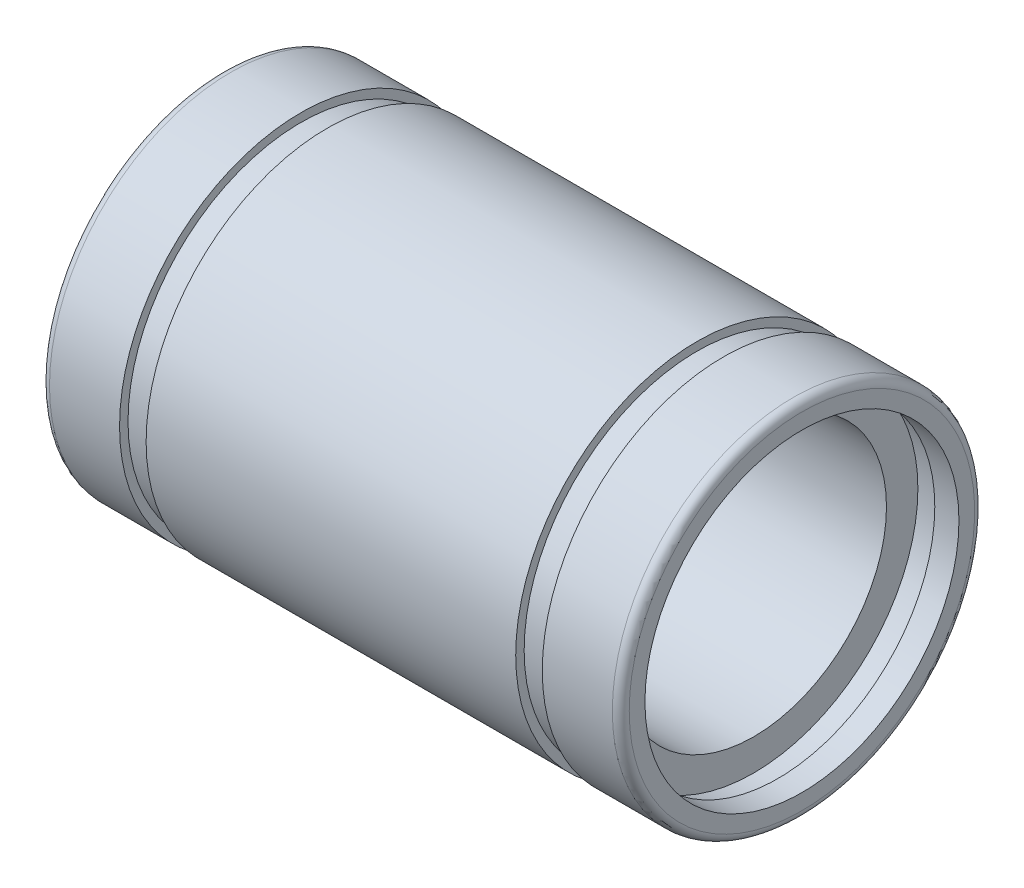
ISO-10303-21;
HEADER;
FILE_DESCRIPTION(('STEP AP214'),'2;1');
FILE_NAME('part.step','',(''),(''),'','','');
FILE_SCHEMA(('AUTOMOTIVE_DESIGN { 1 0 10303 214 1 1 1 1 }'));
ENDSEC;
DATA;
#1=APPLICATION_CONTEXT('core data for automotive mechanical design processes');
#2=APPLICATION_PROTOCOL_DEFINITION('international standard','automotive_design',2000,#1);
#3=PRODUCT_CONTEXT('',#1,'mechanical');
#4=PRODUCT('Part','Part','',(#3));
#5=PRODUCT_RELATED_PRODUCT_CATEGORY('part','',(#4));
#6=PRODUCT_DEFINITION_FORMATION('','',#4);
#7=PRODUCT_DEFINITION_CONTEXT('part definition',#1,'design');
#8=PRODUCT_DEFINITION('design','',#6,#7);
#9=PRODUCT_DEFINITION_SHAPE('','',#8);
#10=(LENGTH_UNIT() NAMED_UNIT(*) SI_UNIT(.MILLI.,.METRE.));
#11=(NAMED_UNIT(*) PLANE_ANGLE_UNIT() SI_UNIT($,.RADIAN.));
#12=(NAMED_UNIT(*) SI_UNIT($,.STERADIAN.) SOLID_ANGLE_UNIT());
#13=UNCERTAINTY_MEASURE_WITH_UNIT(LENGTH_MEASURE(1.E-05),#10,'distance_accuracy_value','');
#14=(GEOMETRIC_REPRESENTATION_CONTEXT(3) GLOBAL_UNCERTAINTY_ASSIGNED_CONTEXT((#13)) GLOBAL_UNIT_ASSIGNED_CONTEXT((#10,
#11,#12)) REPRESENTATION_CONTEXT('',''));
#15=CARTESIAN_POINT('',(0.,0.,0.));
#16=DIRECTION('',(0.,0.,1.));
#17=DIRECTION('',(1.,0.,0.));
#18=AXIS2_PLACEMENT_3D('',#15,#16,#17);
#19=CARTESIAN_POINT('',(23.65,0.,0.));
#20=DIRECTION('',(-1.,0.,0.));
#21=DIRECTION('',(0.,0.,1.));
#22=AXIS2_PLACEMENT_3D('',#19,#20,#21);
#23=TOROIDAL_SURFACE('',#22,7.15,0.35);
#24=CARTESIAN_POINT('',(23.65,0.,0.));
#25=DIRECTION('',(-1.,0.,0.));
#26=DIRECTION('',(0.,0.,1.));
#27=AXIS2_PLACEMENT_3D('',#24,#25,#26);
#28=CIRCLE('',#27,7.5);
#29=CARTESIAN_POINT('',(23.65,0.,7.5));
#30=VERTEX_POINT('',#29);
#31=EDGE_CURVE('E10',#30,#30,#28,.T.);
#32=ORIENTED_EDGE('',*,*,#31,.F.);
#33=EDGE_LOOP('',(#32));
#34=FACE_BOUND('',#33,.T.);
#35=CARTESIAN_POINT('',(24.,0.,0.));
#36=DIRECTION('',(-1.,0.,0.));
#37=DIRECTION('',(0.,0.,1.));
#38=AXIS2_PLACEMENT_3D('',#35,#36,#37);
#39=CIRCLE('',#38,7.15);
#40=CARTESIAN_POINT('',(24.,0.,7.15));
#41=VERTEX_POINT('',#40);
#42=EDGE_CURVE('E101',#41,#41,#39,.T.);
#43=ORIENTED_EDGE('',*,*,#42,.T.);
#44=EDGE_LOOP('',(#43));
#45=FACE_BOUND('',#44,.T.);
#46=ADVANCED_FACE('F31',(#34,#45),#23,.T.);
#47=CARTESIAN_POINT('',(0.,0.,0.));
#48=DIRECTION('',(-1.,0.,0.));
#49=DIRECTION('',(0.,0.,1.));
#50=AXIS2_PLACEMENT_3D('',#47,#48,#49);
#51=CYLINDRICAL_SURFACE('',#50,7.5);
#52=CARTESIAN_POINT('',(20.75,0.,0.));
#53=DIRECTION('',(-1.,0.,0.));
#54=DIRECTION('',(0.,0.,1.));
#55=AXIS2_PLACEMENT_3D('',#52,#53,#54);
#56=CIRCLE('',#55,7.5);
#57=CARTESIAN_POINT('',(20.75,0.,7.5));
#58=VERTEX_POINT('',#57);
#59=EDGE_CURVE('E37',#58,#58,#56,.T.);
#60=ORIENTED_EDGE('',*,*,#59,.F.);
#61=EDGE_LOOP('',(#60));
#62=FACE_BOUND('',#61,.T.);
#63=ORIENTED_EDGE('',*,*,#31,.T.);
#64=EDGE_LOOP('',(#63));
#65=FACE_BOUND('',#64,.T.);
#66=ADVANCED_FACE('F222',(#62,#65),#51,.T.);
#67=CARTESIAN_POINT('',(20.75,7.5,0.));
#68=DIRECTION('',(1.,0.,0.));
#69=DIRECTION('',(0.,0.,-1.));
#70=AXIS2_PLACEMENT_3D('',#67,#68,#69);
#71=PLANE('',#70);
#72=CARTESIAN_POINT('',(20.75,0.,0.));
#73=DIRECTION('',(-1.,0.,0.));
#74=DIRECTION('',(0.,0.,1.));
#75=AXIS2_PLACEMENT_3D('',#72,#73,#74);
#76=CIRCLE('',#75,7.15);
#77=CARTESIAN_POINT('',(20.75,0.,7.15));
#78=VERTEX_POINT('',#77);
#79=EDGE_CURVE('E41',#78,#78,#76,.T.);
#80=ORIENTED_EDGE('',*,*,#79,.F.);
#81=EDGE_LOOP('',(#80));
#82=FACE_BOUND('',#81,.T.);
#83=ORIENTED_EDGE('',*,*,#59,.T.);
#84=EDGE_LOOP('',(#83));
#85=FACE_BOUND('',#84,.T.);
#86=ADVANCED_FACE('F217',(#82,#85),#71,.F.);
#87=CARTESIAN_POINT('',(0.,0.,0.));
#88=DIRECTION('',(-1.,0.,0.));
#89=DIRECTION('',(0.,0.,1.));
#90=AXIS2_PLACEMENT_3D('',#87,#88,#89);
#91=CYLINDRICAL_SURFACE('',#90,7.15);
#92=CARTESIAN_POINT('',(19.65,0.,0.));
#93=DIRECTION('',(-1.,0.,0.));
#94=DIRECTION('',(0.,0.,1.));
#95=AXIS2_PLACEMENT_3D('',#92,#93,#94);
#96=CIRCLE('',#95,7.15);
#97=CARTESIAN_POINT('',(19.65,0.,7.15));
#98=VERTEX_POINT('',#97);
#99=EDGE_CURVE('E45',#98,#98,#96,.T.);
#100=ORIENTED_EDGE('',*,*,#99,.F.);
#101=EDGE_LOOP('',(#100));
#102=FACE_BOUND('',#101,.T.);
#103=ORIENTED_EDGE('',*,*,#79,.T.);
#104=EDGE_LOOP('',(#103));
#105=FACE_BOUND('',#104,.T.);
#106=ADVANCED_FACE('F211',(#102,#105),#91,.T.);
#107=CARTESIAN_POINT('',(19.65,7.15,0.));
#108=DIRECTION('',(-1.,0.,0.));
#109=DIRECTION('',(0.,0.,1.));
#110=AXIS2_PLACEMENT_3D('',#107,#108,#109);
#111=PLANE('',#110);
#112=CARTESIAN_POINT('',(19.65,0.,0.));
#113=DIRECTION('',(-1.,0.,0.));
#114=DIRECTION('',(0.,0.,1.));
#115=AXIS2_PLACEMENT_3D('',#112,#113,#114);
#116=CIRCLE('',#115,7.5);
#117=CARTESIAN_POINT('',(19.65,0.,7.5));
#118=VERTEX_POINT('',#117);
#119=EDGE_CURVE('E50',#118,#118,#116,.T.);
#120=ORIENTED_EDGE('',*,*,#119,.F.);
#121=EDGE_LOOP('',(#120));
#122=FACE_BOUND('',#121,.T.);
#123=ORIENTED_EDGE('',*,*,#99,.T.);
#124=EDGE_LOOP('',(#123));
#125=FACE_BOUND('',#124,.T.);
#126=ADVANCED_FACE('F205',(#122,#125),#111,.F.);
#127=CARTESIAN_POINT('',(0.,0.,0.));
#128=DIRECTION('',(-1.,0.,0.));
#129=DIRECTION('',(0.,0.,1.));
#130=AXIS2_PLACEMENT_3D('',#127,#128,#129);
#131=CYLINDRICAL_SURFACE('',#130,7.5);
#132=CARTESIAN_POINT('',(4.35,0.,0.));
#133=DIRECTION('',(-1.,0.,0.));
#134=DIRECTION('',(0.,0.,1.));
#135=AXIS2_PLACEMENT_3D('',#132,#133,#134);
#136=CIRCLE('',#135,7.5);
#137=CARTESIAN_POINT('',(4.35,0.,7.5));
#138=VERTEX_POINT('',#137);
#139=EDGE_CURVE('E53',#138,#138,#136,.T.);
#140=ORIENTED_EDGE('',*,*,#139,.F.);
#141=EDGE_LOOP('',(#140));
#142=FACE_BOUND('',#141,.T.);
#143=ORIENTED_EDGE('',*,*,#119,.T.);
#144=EDGE_LOOP('',(#143));
#145=FACE_BOUND('',#144,.T.);
#146=ADVANCED_FACE('F199',(#142,#145),#131,.T.);
#147=CARTESIAN_POINT('',(4.35,7.5,0.));
#148=DIRECTION('',(1.,0.,0.));
#149=DIRECTION('',(0.,0.,-1.));
#150=AXIS2_PLACEMENT_3D('',#147,#148,#149);
#151=PLANE('',#150);
#152=CARTESIAN_POINT('',(4.35,0.,0.));
#153=DIRECTION('',(-1.,0.,0.));
#154=DIRECTION('',(0.,0.,1.));
#155=AXIS2_PLACEMENT_3D('',#152,#153,#154);
#156=CIRCLE('',#155,7.15);
#157=CARTESIAN_POINT('',(4.35,0.,7.15));
#158=VERTEX_POINT('',#157);
#159=EDGE_CURVE('E56',#158,#158,#156,.T.);
#160=ORIENTED_EDGE('',*,*,#159,.F.);
#161=EDGE_LOOP('',(#160));
#162=FACE_BOUND('',#161,.T.);
#163=ORIENTED_EDGE('',*,*,#139,.T.);
#164=EDGE_LOOP('',(#163));
#165=FACE_BOUND('',#164,.T.);
#166=ADVANCED_FACE('F193',(#162,#165),#151,.F.);
#167=CARTESIAN_POINT('',(0.,0.,0.));
#168=DIRECTION('',(-1.,0.,0.));
#169=DIRECTION('',(0.,0.,1.));
#170=AXIS2_PLACEMENT_3D('',#167,#168,#169);
#171=CYLINDRICAL_SURFACE('',#170,7.15);
#172=CARTESIAN_POINT('',(3.25,0.,0.));
#173=DIRECTION('',(-1.,0.,0.));
#174=DIRECTION('',(0.,0.,1.));
#175=AXIS2_PLACEMENT_3D('',#172,#173,#174);
#176=CIRCLE('',#175,7.15);
#177=CARTESIAN_POINT('',(3.25,0.,7.15));
#178=VERTEX_POINT('',#177);
#179=EDGE_CURVE('E59',#178,#178,#176,.T.);
#180=ORIENTED_EDGE('',*,*,#179,.F.);
#181=EDGE_LOOP('',(#180));
#182=FACE_BOUND('',#181,.T.);
#183=ORIENTED_EDGE('',*,*,#159,.T.);
#184=EDGE_LOOP('',(#183));
#185=FACE_BOUND('',#184,.T.);
#186=ADVANCED_FACE('F187',(#182,#185),#171,.T.);
#187=CARTESIAN_POINT('',(3.25,7.15,0.));
#188=DIRECTION('',(-1.,0.,0.));
#189=DIRECTION('',(0.,0.,1.));
#190=AXIS2_PLACEMENT_3D('',#187,#188,#189);
#191=PLANE('',#190);
#192=CARTESIAN_POINT('',(3.25,0.,0.));
#193=DIRECTION('',(-1.,0.,0.));
#194=DIRECTION('',(0.,0.,1.));
#195=AXIS2_PLACEMENT_3D('',#192,#193,#194);
#196=CIRCLE('',#195,7.5);
#197=CARTESIAN_POINT('',(3.25,0.,7.5));
#198=VERTEX_POINT('',#197);
#199=EDGE_CURVE('E62',#198,#198,#196,.T.);
#200=ORIENTED_EDGE('',*,*,#199,.F.);
#201=EDGE_LOOP('',(#200));
#202=FACE_BOUND('',#201,.T.);
#203=ORIENTED_EDGE('',*,*,#179,.T.);
#204=EDGE_LOOP('',(#203));
#205=FACE_BOUND('',#204,.T.);
#206=ADVANCED_FACE('F181',(#202,#205),#191,.F.);
#207=CARTESIAN_POINT('',(0.,0.,0.));
#208=DIRECTION('',(-1.,0.,0.));
#209=DIRECTION('',(0.,0.,1.));
#210=AXIS2_PLACEMENT_3D('',#207,#208,#209);
#211=CYLINDRICAL_SURFACE('',#210,7.5);
#212=CARTESIAN_POINT('',(0.350000000000002,0.,0.));
#213=DIRECTION('',(-1.,0.,0.));
#214=DIRECTION('',(0.,0.,1.));
#215=AXIS2_PLACEMENT_3D('',#212,#213,#214);
#216=CIRCLE('',#215,7.5);
#217=CARTESIAN_POINT('',(0.350000000000002,0.,7.5));
#218=VERTEX_POINT('',#217);
#219=EDGE_CURVE('E65',#218,#218,#216,.T.);
#220=ORIENTED_EDGE('',*,*,#219,.F.);
#221=EDGE_LOOP('',(#220));
#222=FACE_BOUND('',#221,.T.);
#223=ORIENTED_EDGE('',*,*,#199,.T.);
#224=EDGE_LOOP('',(#223));
#225=FACE_BOUND('',#224,.T.);
#226=ADVANCED_FACE('F175',(#222,#225),#211,.T.);
#227=CARTESIAN_POINT('',(0.35,0.,0.));
#228=DIRECTION('',(-1.,0.,0.));
#229=DIRECTION('',(0.,0.,1.));
#230=AXIS2_PLACEMENT_3D('',#227,#228,#229);
#231=TOROIDAL_SURFACE('',#230,7.15,0.35);
#232=CARTESIAN_POINT('',(0.,0.,0.));
#233=DIRECTION('',(-1.,0.,0.));
#234=DIRECTION('',(0.,0.,1.));
#235=AXIS2_PLACEMENT_3D('',#232,#233,#234);
#236=CIRCLE('',#235,7.15);
#237=CARTESIAN_POINT('',(0.,0.,7.15));
#238=VERTEX_POINT('',#237);
#239=EDGE_CURVE('E68',#238,#238,#236,.T.);
#240=ORIENTED_EDGE('',*,*,#239,.F.);
#241=EDGE_LOOP('',(#240));
#242=FACE_BOUND('',#241,.T.);
#243=ORIENTED_EDGE('',*,*,#219,.T.);
#244=EDGE_LOOP('',(#243));
#245=FACE_BOUND('',#244,.T.);
#246=ADVANCED_FACE('F169',(#242,#245),#231,.T.);
#247=CARTESIAN_POINT('',(0.,7.15,0.));
#248=DIRECTION('',(1.,0.,0.));
#249=DIRECTION('',(0.,0.,-1.));
#250=AXIS2_PLACEMENT_3D('',#247,#248,#249);
#251=PLANE('',#250);
#252=CARTESIAN_POINT('',(0.,0.,0.));
#253=DIRECTION('',(-1.,0.,0.));
#254=DIRECTION('',(0.,0.,1.));
#255=AXIS2_PLACEMENT_3D('',#252,#253,#254);
#256=CIRCLE('',#255,6.5);
#257=CARTESIAN_POINT('',(0.,0.,6.5));
#258=VERTEX_POINT('',#257);
#259=EDGE_CURVE('E71',#258,#258,#256,.T.);
#260=ORIENTED_EDGE('',*,*,#259,.F.);
#261=EDGE_LOOP('',(#260));
#262=FACE_BOUND('',#261,.T.);
#263=ORIENTED_EDGE('',*,*,#239,.T.);
#264=EDGE_LOOP('',(#263));
#265=FACE_BOUND('',#264,.T.);
#266=ADVANCED_FACE('F163',(#262,#265),#251,.F.);
#267=CARTESIAN_POINT('',(0.,0.,0.));
#268=DIRECTION('',(-1.,0.,0.));
#269=DIRECTION('',(0.,0.,1.));
#270=AXIS2_PLACEMENT_3D('',#267,#268,#269);
#271=CYLINDRICAL_SURFACE('',#270,6.5);
#272=CARTESIAN_POINT('',(1.,0.,0.));
#273=DIRECTION('',(-1.,0.,0.));
#274=DIRECTION('',(0.,0.,1.));
#275=AXIS2_PLACEMENT_3D('',#272,#273,#274);
#276=CIRCLE('',#275,6.5);
#277=CARTESIAN_POINT('',(1.,0.,6.5));
#278=VERTEX_POINT('',#277);
#279=EDGE_CURVE('E74',#278,#278,#276,.T.);
#280=ORIENTED_EDGE('',*,*,#279,.F.);
#281=EDGE_LOOP('',(#280));
#282=FACE_BOUND('',#281,.T.);
#283=ORIENTED_EDGE('',*,*,#259,.T.);
#284=EDGE_LOOP('',(#283));
#285=FACE_BOUND('',#284,.T.);
#286=ADVANCED_FACE('F157',(#282,#285),#271,.F.);
#287=CARTESIAN_POINT('',(1.,6.8,0.));
#288=DIRECTION('',(-1.,0.,0.));
#289=DIRECTION('',(0.,0.,1.));
#290=AXIS2_PLACEMENT_3D('',#287,#288,#289);
#291=PLANE('',#290);
#292=CARTESIAN_POINT('',(1.,0.,0.));
#293=DIRECTION('',(-1.,0.,0.));
#294=DIRECTION('',(0.,0.,1.));
#295=AXIS2_PLACEMENT_3D('',#292,#293,#294);
#296=CIRCLE('',#295,6.8);
#297=CARTESIAN_POINT('',(1.,0.,6.8));
#298=VERTEX_POINT('',#297);
#299=EDGE_CURVE('E77',#298,#298,#296,.T.);
#300=ORIENTED_EDGE('',*,*,#299,.F.);
#301=EDGE_LOOP('',(#300));
#302=FACE_BOUND('',#301,.T.);
#303=ORIENTED_EDGE('',*,*,#279,.T.);
#304=EDGE_LOOP('',(#303));
#305=FACE_BOUND('',#304,.T.);
#306=ADVANCED_FACE('F151',(#302,#305),#291,.F.);
#307=CARTESIAN_POINT('',(0.,0.,0.));
#308=DIRECTION('',(-1.,0.,0.));
#309=DIRECTION('',(0.,0.,1.));
#310=AXIS2_PLACEMENT_3D('',#307,#308,#309);
#311=CYLINDRICAL_SURFACE('',#310,6.8);
#312=CARTESIAN_POINT('',(2.,0.,0.));
#313=DIRECTION('',(-1.,0.,0.));
#314=DIRECTION('',(0.,0.,1.));
#315=AXIS2_PLACEMENT_3D('',#312,#313,#314);
#316=CIRCLE('',#315,6.8);
#317=CARTESIAN_POINT('',(2.,0.,6.8));
#318=VERTEX_POINT('',#317);
#319=EDGE_CURVE('E80',#318,#318,#316,.T.);
#320=ORIENTED_EDGE('',*,*,#319,.F.);
#321=EDGE_LOOP('',(#320));
#322=FACE_BOUND('',#321,.T.);
#323=ORIENTED_EDGE('',*,*,#299,.T.);
#324=EDGE_LOOP('',(#323));
#325=FACE_BOUND('',#324,.T.);
#326=ADVANCED_FACE('F145',(#322,#325),#311,.F.);
#327=CARTESIAN_POINT('',(2.,6.8,0.));
#328=DIRECTION('',(1.,0.,0.));
#329=DIRECTION('',(0.,0.,-1.));
#330=AXIS2_PLACEMENT_3D('',#327,#328,#329);
#331=PLANE('',#330);
#332=CARTESIAN_POINT('',(2.,0.,0.));
#333=DIRECTION('',(-1.,0.,0.));
#334=DIRECTION('',(0.,0.,1.));
#335=AXIS2_PLACEMENT_3D('',#332,#333,#334);
#336=CIRCLE('',#335,5.5);
#337=CARTESIAN_POINT('',(2.,0.,5.5));
#338=VERTEX_POINT('',#337);
#339=EDGE_CURVE('E83',#338,#338,#336,.T.);
#340=ORIENTED_EDGE('',*,*,#339,.F.);
#341=EDGE_LOOP('',(#340));
#342=FACE_BOUND('',#341,.T.);
#343=ORIENTED_EDGE('',*,*,#319,.T.);
#344=EDGE_LOOP('',(#343));
#345=FACE_BOUND('',#344,.T.);
#346=ADVANCED_FACE('F139',(#342,#345),#331,.F.);
#347=CARTESIAN_POINT('',(0.,0.,0.));
#348=DIRECTION('',(-1.,0.,0.));
#349=DIRECTION('',(0.,0.,1.));
#350=AXIS2_PLACEMENT_3D('',#347,#348,#349);
#351=CYLINDRICAL_SURFACE('',#350,5.5);
#352=CARTESIAN_POINT('',(22.,0.,0.));
#353=DIRECTION('',(-1.,0.,0.));
#354=DIRECTION('',(0.,0.,1.));
#355=AXIS2_PLACEMENT_3D('',#352,#353,#354);
#356=CIRCLE('',#355,5.5);
#357=CARTESIAN_POINT('',(22.,0.,5.5));
#358=VERTEX_POINT('',#357);
#359=EDGE_CURVE('E86',#358,#358,#356,.T.);
#360=ORIENTED_EDGE('',*,*,#359,.F.);
#361=EDGE_LOOP('',(#360));
#362=FACE_BOUND('',#361,.T.);
#363=ORIENTED_EDGE('',*,*,#339,.T.);
#364=EDGE_LOOP('',(#363));
#365=FACE_BOUND('',#364,.T.);
#366=ADVANCED_FACE('F133',(#362,#365),#351,.F.);
#367=CARTESIAN_POINT('',(22.,5.5,0.));
#368=DIRECTION('',(-1.,0.,0.));
#369=DIRECTION('',(0.,0.,1.));
#370=AXIS2_PLACEMENT_3D('',#367,#368,#369);
#371=PLANE('',#370);
#372=CARTESIAN_POINT('',(22.,0.,0.));
#373=DIRECTION('',(-1.,0.,0.));
#374=DIRECTION('',(0.,0.,1.));
#375=AXIS2_PLACEMENT_3D('',#372,#373,#374);
#376=CIRCLE('',#375,6.8);
#377=CARTESIAN_POINT('',(22.,0.,6.8));
#378=VERTEX_POINT('',#377);
#379=EDGE_CURVE('E89',#378,#378,#376,.T.);
#380=ORIENTED_EDGE('',*,*,#379,.F.);
#381=EDGE_LOOP('',(#380));
#382=FACE_BOUND('',#381,.T.);
#383=ORIENTED_EDGE('',*,*,#359,.T.);
#384=EDGE_LOOP('',(#383));
#385=FACE_BOUND('',#384,.T.);
#386=ADVANCED_FACE('F127',(#382,#385),#371,.F.);
#387=CARTESIAN_POINT('',(0.,0.,0.));
#388=DIRECTION('',(-1.,0.,0.));
#389=DIRECTION('',(0.,0.,1.));
#390=AXIS2_PLACEMENT_3D('',#387,#388,#389);
#391=CYLINDRICAL_SURFACE('',#390,6.8);
#392=CARTESIAN_POINT('',(23.,0.,0.));
#393=DIRECTION('',(-1.,0.,0.));
#394=DIRECTION('',(0.,0.,1.));
#395=AXIS2_PLACEMENT_3D('',#392,#393,#394);
#396=CIRCLE('',#395,6.8);
#397=CARTESIAN_POINT('',(23.,0.,6.8));
#398=VERTEX_POINT('',#397);
#399=EDGE_CURVE('E92',#398,#398,#396,.T.);
#400=ORIENTED_EDGE('',*,*,#399,.F.);
#401=EDGE_LOOP('',(#400));
#402=FACE_BOUND('',#401,.T.);
#403=ORIENTED_EDGE('',*,*,#379,.T.);
#404=EDGE_LOOP('',(#403));
#405=FACE_BOUND('',#404,.T.);
#406=ADVANCED_FACE('F121',(#402,#405),#391,.F.);
#407=CARTESIAN_POINT('',(23.,6.8,0.));
#408=DIRECTION('',(1.,0.,0.));
#409=DIRECTION('',(0.,0.,-1.));
#410=AXIS2_PLACEMENT_3D('',#407,#408,#409);
#411=PLANE('',#410);
#412=CARTESIAN_POINT('',(23.,0.,0.));
#413=DIRECTION('',(-1.,0.,0.));
#414=DIRECTION('',(0.,0.,1.));
#415=AXIS2_PLACEMENT_3D('',#412,#413,#414);
#416=CIRCLE('',#415,6.5);
#417=CARTESIAN_POINT('',(23.,0.,6.5));
#418=VERTEX_POINT('',#417);
#419=EDGE_CURVE('E95',#418,#418,#416,.T.);
#420=ORIENTED_EDGE('',*,*,#419,.F.);
#421=EDGE_LOOP('',(#420));
#422=FACE_BOUND('',#421,.T.);
#423=ORIENTED_EDGE('',*,*,#399,.T.);
#424=EDGE_LOOP('',(#423));
#425=FACE_BOUND('',#424,.T.);
#426=ADVANCED_FACE('F115',(#422,#425),#411,.F.);
#427=CARTESIAN_POINT('',(0.,0.,0.));
#428=DIRECTION('',(-1.,0.,0.));
#429=DIRECTION('',(0.,0.,1.));
#430=AXIS2_PLACEMENT_3D('',#427,#428,#429);
#431=CYLINDRICAL_SURFACE('',#430,6.5);
#432=CARTESIAN_POINT('',(24.,0.,0.));
#433=DIRECTION('',(-1.,0.,0.));
#434=DIRECTION('',(0.,0.,1.));
#435=AXIS2_PLACEMENT_3D('',#432,#433,#434);
#436=CIRCLE('',#435,6.5);
#437=CARTESIAN_POINT('',(24.,0.,6.5));
#438=VERTEX_POINT('',#437);
#439=EDGE_CURVE('E98',#438,#438,#436,.T.);
#440=ORIENTED_EDGE('',*,*,#439,.F.);
#441=EDGE_LOOP('',(#440));
#442=FACE_BOUND('',#441,.T.);
#443=ORIENTED_EDGE('',*,*,#419,.T.);
#444=EDGE_LOOP('',(#443));
#445=FACE_BOUND('',#444,.T.);
#446=ADVANCED_FACE('F109',(#442,#445),#431,.F.);
#447=CARTESIAN_POINT('',(24.,7.15,0.));
#448=DIRECTION('',(-1.,0.,0.));
#449=DIRECTION('',(0.,0.,1.));
#450=AXIS2_PLACEMENT_3D('',#447,#448,#449);
#451=PLANE('',#450);
#452=ORIENTED_EDGE('',*,*,#42,.F.);
#453=EDGE_LOOP('',(#452));
#454=FACE_BOUND('',#453,.T.);
#455=ORIENTED_EDGE('',*,*,#439,.T.);
#456=EDGE_LOOP('',(#455));
#457=FACE_BOUND('',#456,.T.);
#458=ADVANCED_FACE('F106',(#454,#457),#451,.F.);
#459=CLOSED_SHELL('',(#46,#66,#86,#106,#126,#146,#166,#186,#206,#226,#246,#266,#286,#306,#326,
#346,#366,#386,#406,#426,#446,#458));
#460=MANIFOLD_SOLID_BREP('B2',#459);
#461=ADVANCED_BREP_SHAPE_REPRESENTATION('',(#18,#460),#14);
#462=SHAPE_DEFINITION_REPRESENTATION(#9,#461);
ENDSEC;
END-ISO-10303-21;
